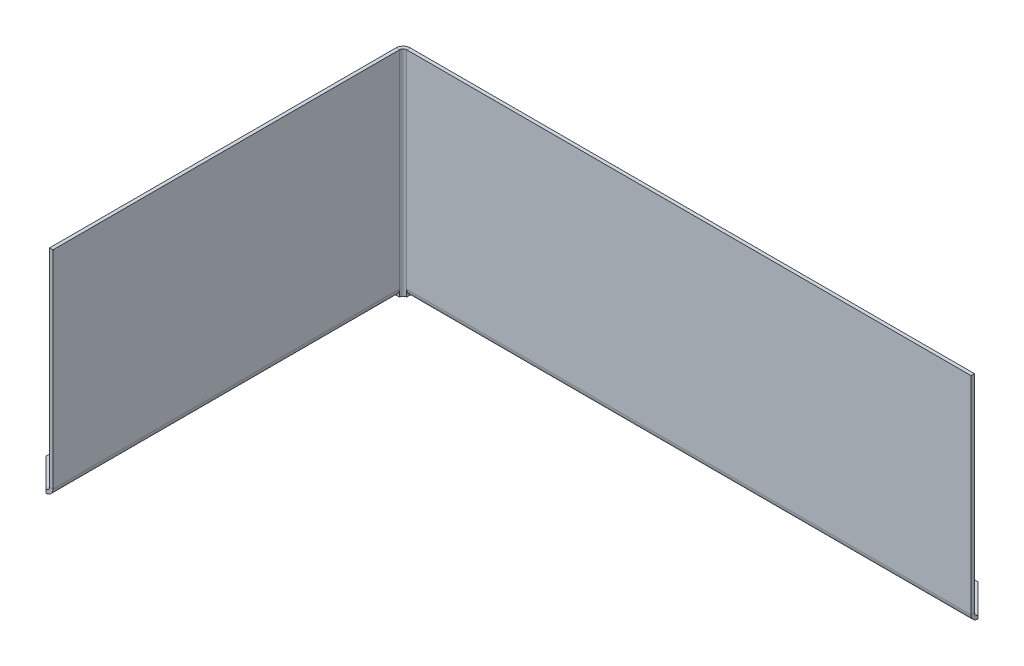
ISO-10303-21;
HEADER;
FILE_DESCRIPTION(('STEP AP214'),'2;1');
FILE_NAME('part.step','',(''),(''),'','','');
FILE_SCHEMA(('AUTOMOTIVE_DESIGN { 1 0 10303 214 1 1 1 1 }'));
ENDSEC;
DATA;
#1=APPLICATION_CONTEXT('core data for automotive mechanical design processes');
#2=APPLICATION_PROTOCOL_DEFINITION('international standard','automotive_design',2000,#1);
#3=PRODUCT_CONTEXT('',#1,'mechanical');
#4=PRODUCT('Part','Part','',(#3));
#5=PRODUCT_RELATED_PRODUCT_CATEGORY('part','',(#4));
#6=PRODUCT_DEFINITION_FORMATION('','',#4);
#7=PRODUCT_DEFINITION_CONTEXT('part definition',#1,'design');
#8=PRODUCT_DEFINITION('design','',#6,#7);
#9=PRODUCT_DEFINITION_SHAPE('','',#8);
#10=(LENGTH_UNIT() NAMED_UNIT(*) SI_UNIT(.MILLI.,.METRE.));
#11=(NAMED_UNIT(*) PLANE_ANGLE_UNIT() SI_UNIT($,.RADIAN.));
#12=(NAMED_UNIT(*) SI_UNIT($,.STERADIAN.) SOLID_ANGLE_UNIT());
#13=UNCERTAINTY_MEASURE_WITH_UNIT(LENGTH_MEASURE(1.E-05),#10,'distance_accuracy_value','');
#14=(GEOMETRIC_REPRESENTATION_CONTEXT(3) GLOBAL_UNCERTAINTY_ASSIGNED_CONTEXT((#13)) GLOBAL_UNIT_ASSIGNED_CONTEXT((#10,
#11,#12)) REPRESENTATION_CONTEXT('',''));
#15=CARTESIAN_POINT('',(0.,0.,0.));
#16=DIRECTION('',(0.,0.,1.));
#17=DIRECTION('',(1.,0.,0.));
#18=AXIS2_PLACEMENT_3D('',#15,#16,#17);
#19=CARTESIAN_POINT('',(1.26999999999998,0.,-125.73));
#20=DIRECTION('',(1.,0.,0.));
#21=DIRECTION('',(0.,1.,0.));
#22=AXIS2_PLACEMENT_3D('',#19,#20,#21);
#23=PLANE('',#22);
#24=DIRECTION('',(0.,1.,-1.33804799689678E-13));
#25=VECTOR('',#24,1.);
#26=CARTESIAN_POINT('',(1.26999999999998,0.,-125.73));
#27=LINE('',#26,#25);
#28=CARTESIAN_POINT('',(1.26999999999998,0.,-125.73));
#29=VERTEX_POINT('',#28);
#30=CARTESIAN_POINT('',(1.26999999999998,0.348355157420486,-125.73));
#31=VERTEX_POINT('',#30);
#32=EDGE_CURVE('E412',#29,#31,#27,.T.);
#33=ORIENTED_EDGE('',*,*,#32,.T.);
#34=CARTESIAN_POINT('',(1.26999999999997,2.4892,-127.));
#35=DIRECTION('',(-1.,0.,0.));
#36=DIRECTION('',(0.,0.,1.));
#37=AXIS2_PLACEMENT_3D('',#34,#35,#36);
#38=CIRCLE('',#37,2.4892);
#39=CARTESIAN_POINT('',(1.26999999999999,2.4892,-124.5108));
#40=VERTEX_POINT('',#39);
#41=EDGE_CURVE('E236',#31,#40,#38,.T.);
#42=ORIENTED_EDGE('',*,*,#41,.T.);
#43=DIRECTION('',(0.,1.,0.));
#44=VECTOR('',#43,1.);
#45=CARTESIAN_POINT('',(1.26999999999999,0.,-124.5108));
#46=LINE('',#45,#44);
#47=CARTESIAN_POINT('',(1.26999999999999,0.,-124.5108));
#48=VERTEX_POINT('',#47);
#49=EDGE_CURVE('E348',#48,#40,#46,.T.);
#50=ORIENTED_EDGE('',*,*,#49,.F.);
#51=DIRECTION('',(0.,0.,1.));
#52=VECTOR('',#51,1.);
#53=CARTESIAN_POINT('',(1.26999999999999,0.,-125.73));
#54=LINE('',#53,#52);
#55=EDGE_CURVE('E329',#48,#29,#54,.F.);
#56=ORIENTED_EDGE('',*,*,#55,.T.);
#57=EDGE_LOOP('',(#33,#42,#50,#56));
#58=FACE_BOUND('',#57,.T.);
#59=ADVANCED_FACE('F96',(#58),#23,.T.);
#60=CARTESIAN_POINT('',(-4.36192488398679E-13,0.,-125.73));
#61=DIRECTION('',(0.,0.,1.));
#62=DIRECTION('',(1.,0.,0.));
#63=AXIS2_PLACEMENT_3D('',#60,#61,#62);
#64=PLANE('',#63);
#65=DIRECTION('',(-1.,0.,0.));
#66=VECTOR('',#65,1.);
#67=CARTESIAN_POINT('',(1.26999999999997,2.4892,-125.73));
#68=LINE('',#67,#66);
#69=CARTESIAN_POINT('',(1.26999999999997,2.4892,-125.73));
#70=VERTEX_POINT('',#69);
#71=CARTESIAN_POINT('',(201.9808,2.4892,-125.730000000001));
#72=VERTEX_POINT('',#71);
#73=EDGE_CURVE('E403',#70,#72,#68,.F.);
#74=ORIENTED_EDGE('',*,*,#73,.F.);
#75=DIRECTION('',(0.,1.,0.));
#76=VECTOR('',#75,1.);
#77=CARTESIAN_POINT('',(1.26999999999999,0.,-125.73));
#78=LINE('',#77,#76);
#79=CARTESIAN_POINT('',(1.26999999999999,76.2,-125.73));
#80=VERTEX_POINT('',#79);
#81=EDGE_CURVE('E343',#80,#70,#78,.F.);
#82=ORIENTED_EDGE('',*,*,#81,.F.);
#83=DIRECTION('',(1.,0.,0.));
#84=VECTOR('',#83,1.);
#85=CARTESIAN_POINT('',(-4.36192488398679E-13,76.2,-125.73));
#86=LINE('',#85,#84);
#87=CARTESIAN_POINT('',(201.9808,76.2,-125.730000000001));
#88=VERTEX_POINT('',#87);
#89=EDGE_CURVE('E337',#80,#88,#86,.T.);
#90=ORIENTED_EDGE('',*,*,#89,.T.);
#91=DIRECTION('',(0.,-1.,0.));
#92=VECTOR('',#91,1.);
#93=CARTESIAN_POINT('',(201.9808,0.,-125.730000000001));
#94=LINE('',#93,#92);
#95=EDGE_CURVE('E334',#88,#72,#94,.T.);
#96=ORIENTED_EDGE('',*,*,#95,.T.);
#97=EDGE_LOOP('',(#74,#82,#90,#96));
#98=FACE_BOUND('',#97,.T.);
#99=ADVANCED_FACE('F459',(#98),#64,.F.);
#100=CARTESIAN_POINT('',(-4.31935674350362E-13,0.,-124.5108));
#101=DIRECTION('',(0.,0.,1.));
#102=DIRECTION('',(1.,0.,0.));
#103=AXIS2_PLACEMENT_3D('',#100,#101,#102);
#104=PLANE('',#103);
#105=CARTESIAN_POINT('',(1.26999999999999,76.2,-124.5108));
#106=VERTEX_POINT('',#105);
#107=EDGE_CURVE('E351',#40,#106,#46,.T.);
#108=ORIENTED_EDGE('',*,*,#107,.F.);
#109=DIRECTION('',(-1.,0.,0.));
#110=VECTOR('',#109,1.);
#111=CARTESIAN_POINT('',(1.26999999999997,2.4892,-124.5108));
#112=LINE('',#111,#110);
#113=CARTESIAN_POINT('',(201.9808,2.4892,-124.510800000001));
#114=VERTEX_POINT('',#113);
#115=EDGE_CURVE('E239',#40,#114,#112,.F.);
#116=ORIENTED_EDGE('',*,*,#115,.T.);
#117=DIRECTION('',(0.,1.,0.));
#118=VECTOR('',#117,1.);
#119=CARTESIAN_POINT('',(201.9808,0.,-124.510800000001));
#120=LINE('',#119,#118);
#121=CARTESIAN_POINT('',(201.9808,76.2,-124.510800000001));
#122=VERTEX_POINT('',#121);
#123=EDGE_CURVE('E339',#122,#114,#120,.F.);
#124=ORIENTED_EDGE('',*,*,#123,.F.);
#125=DIRECTION('',(-1.,0.,0.));
#126=VECTOR('',#125,1.);
#127=CARTESIAN_POINT('',(201.9808,76.2,-124.510800000001));
#128=LINE('',#127,#126);
#129=EDGE_CURVE('E341',#106,#122,#128,.F.);
#130=ORIENTED_EDGE('',*,*,#129,.F.);
#131=EDGE_LOOP('',(#108,#116,#124,#130));
#132=FACE_BOUND('',#131,.T.);
#133=ADVANCED_FACE('F452',(#132),#104,.T.);
#134=CARTESIAN_POINT('',(201.9808,0.,-125.730000000001));
#135=DIRECTION('',(-1.,0.,0.));
#136=DIRECTION('',(0.,0.,1.));
#137=AXIS2_PLACEMENT_3D('',#134,#135,#136);
#138=PLANE('',#137);
#139=DIRECTION('',(0.,0.,1.));
#140=VECTOR('',#139,1.);
#141=CARTESIAN_POINT('',(201.9808,2.4892,-125.73));
#142=LINE('',#141,#140);
#143=EDGE_CURVE('E408',#72,#114,#142,.T.);
#144=ORIENTED_EDGE('',*,*,#143,.F.);
#145=ORIENTED_EDGE('',*,*,#95,.F.);
#146=DIRECTION('',(0.,0.,1.));
#147=VECTOR('',#146,1.);
#148=CARTESIAN_POINT('',(201.9808,76.2,-125.730000000001));
#149=LINE('',#148,#147);
#150=EDGE_CURVE('E330',#88,#122,#149,.T.);
#151=ORIENTED_EDGE('',*,*,#150,.T.);
#152=ORIENTED_EDGE('',*,*,#123,.T.);
#153=EDGE_LOOP('',(#144,#145,#151,#152));
#154=FACE_BOUND('',#153,.T.);
#155=ADVANCED_FACE('F455',(#154),#138,.F.);
#156=CARTESIAN_POINT('',(-1.2192,2.4892,-123.2408));
#157=DIRECTION('',(0.,0.,1.));
#158=DIRECTION('',(1.,0.,0.));
#159=AXIS2_PLACEMENT_3D('',#156,#157,#158);
#160=PLANE('',#159);
#161=DIRECTION('',(0.,1.,0.));
#162=VECTOR('',#161,1.);
#163=CARTESIAN_POINT('',(0.,76.2,-123.2408));
#164=LINE('',#163,#162);
#165=CARTESIAN_POINT('',(0.,2.4892,-123.2408));
#166=VERTEX_POINT('',#165);
#167=CARTESIAN_POINT('',(0.,0.,-123.2408));
#168=VERTEX_POINT('',#167);
#169=EDGE_CURVE('E370',#166,#168,#164,.F.);
#170=ORIENTED_EDGE('',*,*,#169,.F.);
#171=CARTESIAN_POINT('',(-2.4892,2.4892,-123.2408));
#172=DIRECTION('',(0.,0.,1.));
#173=DIRECTION('',(1.,0.,0.));
#174=AXIS2_PLACEMENT_3D('',#171,#172,#173);
#175=CIRCLE('',#174,2.4892);
#176=CARTESIAN_POINT('',(-1.2192,0.348355157420319,-123.2408));
#177=VERTEX_POINT('',#176);
#178=EDGE_CURVE('E325',#166,#177,#175,.F.);
#179=ORIENTED_EDGE('',*,*,#178,.T.);
#180=DIRECTION('',(0.,-1.,0.));
#181=VECTOR('',#180,1.);
#182=CARTESIAN_POINT('',(-1.2192,2.4892,-123.2408));
#183=LINE('',#182,#181);
#184=CARTESIAN_POINT('',(-1.2192,0.,-123.2408));
#185=VERTEX_POINT('',#184);
#186=EDGE_CURVE('E324',#177,#185,#183,.T.);
#187=ORIENTED_EDGE('',*,*,#186,.T.);
#188=DIRECTION('',(-1.,0.,0.));
#189=VECTOR('',#188,1.);
#190=CARTESIAN_POINT('',(0.,0.,-123.2408));
#191=LINE('',#190,#189);
#192=EDGE_CURVE('E373',#168,#185,#191,.T.);
#193=ORIENTED_EDGE('',*,*,#192,.F.);
#194=EDGE_LOOP('',(#170,#179,#187,#193));
#195=FACE_BOUND('',#194,.T.);
#196=ADVANCED_FACE('F513',(#195),#160,.T.);
#197=CARTESIAN_POINT('',(-1.2192,0.,0.));
#198=DIRECTION('',(-1.,0.,0.));
#199=DIRECTION('',(0.,0.,1.));
#200=AXIS2_PLACEMENT_3D('',#197,#198,#199);
#201=PLANE('',#200);
#202=DIRECTION('',(0.,1.,0.));
#203=VECTOR('',#202,1.);
#204=CARTESIAN_POINT('',(-1.2192,76.2,-123.2408));
#205=LINE('',#204,#203);
#206=CARTESIAN_POINT('',(-1.2192,76.2,-123.2408));
#207=VERTEX_POINT('',#206);
#208=CARTESIAN_POINT('',(-1.2192,2.4892,-123.2408));
#209=VERTEX_POINT('',#208);
#210=EDGE_CURVE('E354',#207,#209,#205,.F.);
#211=ORIENTED_EDGE('',*,*,#210,.T.);
#212=DIRECTION('',(0.,0.,1.));
#213=VECTOR('',#212,1.);
#214=CARTESIAN_POINT('',(-1.2192,2.4892,0.));
#215=LINE('',#214,#213);
#216=CARTESIAN_POINT('',(-1.2192,2.4892,0.));
#217=VERTEX_POINT('',#216);
#218=EDGE_CURVE('E318',#217,#209,#215,.F.);
#219=ORIENTED_EDGE('',*,*,#218,.F.);
#220=DIRECTION('',(0.,-1.,0.));
#221=VECTOR('',#220,1.);
#222=CARTESIAN_POINT('',(-1.2192,0.,0.));
#223=LINE('',#222,#221);
#224=CARTESIAN_POINT('',(-1.2192,76.2,0.));
#225=VERTEX_POINT('',#224);
#226=EDGE_CURVE('E379',#225,#217,#223,.T.);
#227=ORIENTED_EDGE('',*,*,#226,.F.);
#228=DIRECTION('',(0.,0.,1.));
#229=VECTOR('',#228,1.);
#230=CARTESIAN_POINT('',(-1.2192,76.2,0.));
#231=LINE('',#230,#229);
#232=EDGE_CURVE('E382',#207,#225,#231,.T.);
#233=ORIENTED_EDGE('',*,*,#232,.F.);
#234=EDGE_LOOP('',(#211,#219,#227,#233));
#235=FACE_BOUND('',#234,.T.);
#236=ADVANCED_FACE('F515',(#235),#201,.T.);
#237=CARTESIAN_POINT('',(0.,0.,0.));
#238=DIRECTION('',(-1.,0.,0.));
#239=DIRECTION('',(0.,0.,1.));
#240=AXIS2_PLACEMENT_3D('',#237,#238,#239);
#241=PLANE('',#240);
#242=DIRECTION('',(0.,0.,1.));
#243=VECTOR('',#242,1.);
#244=CARTESIAN_POINT('',(0.,2.4892,0.));
#245=LINE('',#244,#243);
#246=CARTESIAN_POINT('',(0.,2.4892,0.));
#247=VERTEX_POINT('',#246);
#248=EDGE_CURVE('E419',#247,#166,#245,.F.);
#249=ORIENTED_EDGE('',*,*,#248,.T.);
#250=CARTESIAN_POINT('',(0.,76.2,-123.2408));
#251=VERTEX_POINT('',#250);
#252=EDGE_CURVE('E367',#251,#166,#164,.F.);
#253=ORIENTED_EDGE('',*,*,#252,.F.);
#254=DIRECTION('',(0.,0.,1.));
#255=VECTOR('',#254,1.);
#256=CARTESIAN_POINT('',(0.,76.2,0.));
#257=LINE('',#256,#255);
#258=CARTESIAN_POINT('',(0.,76.2,0.));
#259=VERTEX_POINT('',#258);
#260=EDGE_CURVE('E383',#251,#259,#257,.T.);
#261=ORIENTED_EDGE('',*,*,#260,.T.);
#262=DIRECTION('',(0.,-1.,0.));
#263=VECTOR('',#262,1.);
#264=CARTESIAN_POINT('',(0.,0.,0.));
#265=LINE('',#264,#263);
#266=EDGE_CURVE('E376',#259,#247,#265,.T.);
#267=ORIENTED_EDGE('',*,*,#266,.T.);
#268=EDGE_LOOP('',(#249,#253,#261,#267));
#269=FACE_BOUND('',#268,.T.);
#270=ADVANCED_FACE('F433',(#269),#241,.F.);
#271=CARTESIAN_POINT('',(-1.2192,0.,0.));
#272=DIRECTION('',(0.,0.,1.));
#273=DIRECTION('',(1.,0.,0.));
#274=AXIS2_PLACEMENT_3D('',#271,#272,#273);
#275=PLANE('',#274);
#276=ORIENTED_EDGE('',*,*,#226,.T.);
#277=DIRECTION('',(1.,0.,0.));
#278=VECTOR('',#277,1.);
#279=CARTESIAN_POINT('',(-1.2192,2.4892,0.));
#280=LINE('',#279,#278);
#281=EDGE_CURVE('E317',#217,#247,#280,.T.);
#282=ORIENTED_EDGE('',*,*,#281,.T.);
#283=ORIENTED_EDGE('',*,*,#266,.F.);
#284=DIRECTION('',(1.,0.,0.));
#285=VECTOR('',#284,1.);
#286=CARTESIAN_POINT('',(-1.2192,76.2,0.));
#287=LINE('',#286,#285);
#288=EDGE_CURVE('E385',#225,#259,#287,.T.);
#289=ORIENTED_EDGE('',*,*,#288,.F.);
#290=EDGE_LOOP('',(#276,#282,#283,#289));
#291=FACE_BOUND('',#290,.T.);
#292=ADVANCED_FACE('F542',(#291),#275,.T.);
#293=CARTESIAN_POINT('',(-1.2192,76.2,0.));
#294=DIRECTION('',(0.,1.,0.));
#295=DIRECTION('',(0.,0.,1.));
#296=AXIS2_PLACEMENT_3D('',#293,#294,#295);
#297=PLANE('',#296);
#298=ORIENTED_EDGE('',*,*,#260,.F.);
#299=DIRECTION('',(-1.,0.,0.));
#300=VECTOR('',#299,1.);
#301=CARTESIAN_POINT('',(0.,76.2,-123.2408));
#302=LINE('',#301,#300);
#303=EDGE_CURVE('E361',#251,#207,#302,.T.);
#304=ORIENTED_EDGE('',*,*,#303,.T.);
#305=ORIENTED_EDGE('',*,*,#232,.T.);
#306=ORIENTED_EDGE('',*,*,#288,.T.);
#307=EDGE_LOOP('',(#298,#304,#305,#306));
#308=FACE_BOUND('',#307,.T.);
#309=ADVANCED_FACE('F533',(#308),#297,.T.);
#310=CARTESIAN_POINT('',(1.26999999999999,0.,-123.2408));
#311=DIRECTION('',(0.,-1.,0.));
#312=DIRECTION('',(0.,0.,-1.));
#313=AXIS2_PLACEMENT_3D('',#310,#311,#312);
#314=PLANE('',#313);
#315=ORIENTED_EDGE('',*,*,#55,.F.);
#316=CARTESIAN_POINT('',(1.26999999999999,0.,-123.2408));
#317=DIRECTION('',(0.,1.,0.));
#318=DIRECTION('',(0.,0.,1.));
#319=AXIS2_PLACEMENT_3D('',#316,#317,#318);
#320=CIRCLE('',#319,1.26999999999999);
#321=EDGE_CURVE('E364',#168,#48,#320,.F.);
#322=ORIENTED_EDGE('',*,*,#321,.F.);
#323=ORIENTED_EDGE('',*,*,#192,.T.);
#324=CARTESIAN_POINT('',(1.26999999999999,0.,-123.2408));
#325=DIRECTION('',(0.,1.,0.));
#326=DIRECTION('',(0.,0.,1.));
#327=AXIS2_PLACEMENT_3D('',#324,#325,#326);
#328=CIRCLE('',#327,2.48919999999999);
#329=EDGE_CURVE('E357',#185,#29,#328,.F.);
#330=ORIENTED_EDGE('',*,*,#329,.T.);
#331=EDGE_LOOP('',(#315,#322,#323,#330));
#332=FACE_BOUND('',#331,.T.);
#333=ADVANCED_FACE('F530',(#332),#314,.T.);
#334=CARTESIAN_POINT('',(1.26999999999999,76.2,-123.2408));
#335=DIRECTION('',(0.,-1.,0.));
#336=DIRECTION('',(0.,0.,-1.));
#337=AXIS2_PLACEMENT_3D('',#334,#335,#336);
#338=PLANE('',#337);
#339=CARTESIAN_POINT('',(1.26999999999999,76.2,-123.2408));
#340=DIRECTION('',(0.,1.,0.));
#341=DIRECTION('',(0.,0.,1.));
#342=AXIS2_PLACEMENT_3D('',#339,#340,#341);
#343=CIRCLE('',#342,1.26999999999999);
#344=EDGE_CURVE('E333',#106,#251,#343,.T.);
#345=ORIENTED_EDGE('',*,*,#344,.F.);
#346=DIRECTION('',(0.,0.,1.));
#347=VECTOR('',#346,1.);
#348=CARTESIAN_POINT('',(1.26999999999999,76.2,-124.5108));
#349=LINE('',#348,#347);
#350=EDGE_CURVE('E345',#106,#80,#349,.F.);
#351=ORIENTED_EDGE('',*,*,#350,.T.);
#352=CARTESIAN_POINT('',(1.26999999999999,76.2,-123.2408));
#353=DIRECTION('',(0.,1.,0.));
#354=DIRECTION('',(0.,0.,1.));
#355=AXIS2_PLACEMENT_3D('',#352,#353,#354);
#356=CIRCLE('',#355,2.48919999999999);
#357=EDGE_CURVE('E358',#80,#207,#356,.T.);
#358=ORIENTED_EDGE('',*,*,#357,.T.);
#359=ORIENTED_EDGE('',*,*,#303,.F.);
#360=EDGE_LOOP('',(#345,#351,#358,#359));
#361=FACE_BOUND('',#360,.T.);
#362=ADVANCED_FACE('F443',(#361),#338,.F.);
#363=CARTESIAN_POINT('',(1.26999999999999,76.2,-123.2408));
#364=DIRECTION('',(0.,1.,0.));
#365=DIRECTION('',(0.,0.,-1.));
#366=AXIS2_PLACEMENT_3D('',#363,#364,#365);
#367=CYLINDRICAL_SURFACE('',#366,2.48919999999999);
#368=ORIENTED_EDGE('',*,*,#210,.F.);
#369=ORIENTED_EDGE('',*,*,#357,.F.);
#370=ORIENTED_EDGE('',*,*,#81,.T.);
#371=EDGE_CURVE('E411',#31,#70,#27,.T.);
#372=ORIENTED_EDGE('',*,*,#371,.F.);
#373=ORIENTED_EDGE('',*,*,#32,.F.);
#374=ORIENTED_EDGE('',*,*,#329,.F.);
#375=ORIENTED_EDGE('',*,*,#186,.F.);
#376=EDGE_CURVE('E326',#209,#177,#183,.T.);
#377=ORIENTED_EDGE('',*,*,#376,.F.);
#378=EDGE_LOOP('',(#368,#369,#370,#372,#373,#374,#375,#377));
#379=FACE_BOUND('',#378,.T.);
#380=ADVANCED_FACE('F524',(#379),#367,.T.);
#381=CARTESIAN_POINT('',(1.26999999999999,76.2,-123.2408));
#382=DIRECTION('',(0.,1.,0.));
#383=DIRECTION('',(0.,0.,-1.));
#384=AXIS2_PLACEMENT_3D('',#381,#382,#383);
#385=CYLINDRICAL_SURFACE('',#384,1.26999999999999);
#386=ORIENTED_EDGE('',*,*,#252,.T.);
#387=ORIENTED_EDGE('',*,*,#169,.T.);
#388=ORIENTED_EDGE('',*,*,#321,.T.);
#389=ORIENTED_EDGE('',*,*,#49,.T.);
#390=ORIENTED_EDGE('',*,*,#107,.T.);
#391=ORIENTED_EDGE('',*,*,#344,.T.);
#392=EDGE_LOOP('',(#386,#387,#388,#389,#390,#391));
#393=FACE_BOUND('',#392,.T.);
#394=ADVANCED_FACE('F438',(#393),#385,.F.);
#395=CARTESIAN_POINT('',(201.9808,76.2,-125.730000000001));
#396=DIRECTION('',(0.,-1.,0.));
#397=DIRECTION('',(0.,0.,-1.));
#398=AXIS2_PLACEMENT_3D('',#395,#396,#397);
#399=PLANE('',#398);
#400=ORIENTED_EDGE('',*,*,#350,.F.);
#401=ORIENTED_EDGE('',*,*,#129,.T.);
#402=ORIENTED_EDGE('',*,*,#150,.F.);
#403=ORIENTED_EDGE('',*,*,#89,.F.);
#404=EDGE_LOOP('',(#400,#401,#402,#403));
#405=FACE_BOUND('',#404,.T.);
#406=ADVANCED_FACE('F448',(#405),#399,.F.);
#407=CARTESIAN_POINT('',(-2.4892,2.4892,-123.2408));
#408=DIRECTION('',(0.,0.,-1.));
#409=DIRECTION('',(-1.,0.,0.));
#410=AXIS2_PLACEMENT_3D('',#407,#408,#409);
#411=PLANE('',#410);
#412=CARTESIAN_POINT('',(-2.4892,2.4892,-123.2408));
#413=DIRECTION('',(0.,0.,1.));
#414=DIRECTION('',(1.,0.,0.));
#415=AXIS2_PLACEMENT_3D('',#412,#413,#414);
#416=CIRCLE('',#415,1.27);
#417=CARTESIAN_POINT('',(-2.4892,1.2192,-123.2408));
#418=VERTEX_POINT('',#417);
#419=EDGE_CURVE('E310',#209,#418,#416,.F.);
#420=ORIENTED_EDGE('',*,*,#419,.F.);
#421=ORIENTED_EDGE('',*,*,#376,.T.);
#422=CARTESIAN_POINT('',(-2.48919999999999,0.,-123.2408));
#423=VERTEX_POINT('',#422);
#424=EDGE_CURVE('E422',#177,#423,#175,.F.);
#425=ORIENTED_EDGE('',*,*,#424,.T.);
#426=DIRECTION('',(0.,1.,0.));
#427=VECTOR('',#426,1.);
#428=CARTESIAN_POINT('',(-2.48919999999999,0.,-123.2408));
#429=LINE('',#428,#427);
#430=EDGE_CURVE('E311',#418,#423,#429,.F.);
#431=ORIENTED_EDGE('',*,*,#430,.F.);
#432=EDGE_LOOP('',(#420,#421,#425,#431));
#433=FACE_BOUND('',#432,.T.);
#434=ADVANCED_FACE('F507',(#433),#411,.T.);
#435=CARTESIAN_POINT('',(-2.4892,2.4892,0.));
#436=DIRECTION('',(0.,0.,-1.));
#437=DIRECTION('',(-1.,0.,0.));
#438=AXIS2_PLACEMENT_3D('',#435,#436,#437);
#439=PLANE('',#438);
#440=CARTESIAN_POINT('',(-2.4892,2.4892,0.));
#441=DIRECTION('',(0.,0.,1.));
#442=DIRECTION('',(1.,0.,0.));
#443=AXIS2_PLACEMENT_3D('',#440,#441,#442);
#444=CIRCLE('',#443,1.27);
#445=CARTESIAN_POINT('',(-2.4892,1.2192,0.));
#446=VERTEX_POINT('',#445);
#447=EDGE_CURVE('E294',#446,#217,#444,.T.);
#448=ORIENTED_EDGE('',*,*,#447,.F.);
#449=DIRECTION('',(0.,1.,0.));
#450=VECTOR('',#449,1.);
#451=CARTESIAN_POINT('',(-2.4892,1.2192,0.));
#452=LINE('',#451,#450);
#453=CARTESIAN_POINT('',(-2.48919999999999,0.,0.));
#454=VERTEX_POINT('',#453);
#455=EDGE_CURVE('E299',#446,#454,#452,.F.);
#456=ORIENTED_EDGE('',*,*,#455,.T.);
#457=CARTESIAN_POINT('',(-2.4892,2.4892,0.));
#458=DIRECTION('',(0.,0.,1.));
#459=DIRECTION('',(1.,0.,0.));
#460=AXIS2_PLACEMENT_3D('',#457,#458,#459);
#461=CIRCLE('',#460,2.4892);
#462=EDGE_CURVE('E423',#454,#247,#461,.T.);
#463=ORIENTED_EDGE('',*,*,#462,.T.);
#464=ORIENTED_EDGE('',*,*,#281,.F.);
#465=EDGE_LOOP('',(#448,#456,#463,#464));
#466=FACE_BOUND('',#465,.T.);
#467=ADVANCED_FACE('F315',(#466),#439,.F.);
#468=CARTESIAN_POINT('',(-2.4892,2.4892,0.));
#469=DIRECTION('',(0.,0.,1.));
#470=DIRECTION('',(0.,-1.,0.));
#471=AXIS2_PLACEMENT_3D('',#468,#469,#470);
#472=CYLINDRICAL_SURFACE('',#471,2.4892);
#473=ORIENTED_EDGE('',*,*,#248,.F.);
#474=ORIENTED_EDGE('',*,*,#462,.F.);
#475=DIRECTION('',(0.,0.,1.));
#476=VECTOR('',#475,1.);
#477=CARTESIAN_POINT('',(-2.48919999999999,0.,-123.2408));
#478=LINE('',#477,#476);
#479=EDGE_CURVE('E289',#454,#423,#478,.F.);
#480=ORIENTED_EDGE('',*,*,#479,.T.);
#481=ORIENTED_EDGE('',*,*,#424,.F.);
#482=ORIENTED_EDGE('',*,*,#178,.F.);
#483=EDGE_LOOP('',(#473,#474,#480,#481,#482));
#484=FACE_BOUND('',#483,.T.);
#485=ADVANCED_FACE('F428',(#484),#472,.T.);
#486=CARTESIAN_POINT('',(-2.4892,2.4892,0.));
#487=DIRECTION('',(0.,0.,1.));
#488=DIRECTION('',(0.,-1.,0.));
#489=AXIS2_PLACEMENT_3D('',#486,#487,#488);
#490=CYLINDRICAL_SURFACE('',#489,1.27);
#491=ORIENTED_EDGE('',*,*,#218,.T.);
#492=ORIENTED_EDGE('',*,*,#419,.T.);
#493=DIRECTION('',(0.,0.,1.));
#494=VECTOR('',#493,1.);
#495=CARTESIAN_POINT('',(-2.4892,1.2192,-123.2408));
#496=LINE('',#495,#494);
#497=EDGE_CURVE('E302',#418,#446,#496,.T.);
#498=ORIENTED_EDGE('',*,*,#497,.T.);
#499=ORIENTED_EDGE('',*,*,#447,.T.);
#500=EDGE_LOOP('',(#491,#492,#498,#499));
#501=FACE_BOUND('',#500,.T.);
#502=ADVANCED_FACE('F308',(#501),#490,.F.);
#503=CARTESIAN_POINT('',(0.,0.,0.));
#504=DIRECTION('',(0.,1.,0.));
#505=DIRECTION('',(-1.,0.,0.));
#506=AXIS2_PLACEMENT_3D('',#503,#504,#505);
#507=PLANE('',#506);
#508=DIRECTION('',(0.,0.,-1.));
#509=VECTOR('',#508,1.);
#510=CARTESIAN_POINT('',(-12.7,0.,0.));
#511=LINE('',#510,#509);
#512=CARTESIAN_POINT('',(-12.7,0.,-10.2108));
#513=VERTEX_POINT('',#512);
#514=CARTESIAN_POINT('',(-12.7,0.,-113.03));
#515=VERTEX_POINT('',#514);
#516=EDGE_CURVE('E286',#513,#515,#511,.T.);
#517=ORIENTED_EDGE('',*,*,#516,.T.);
#518=DIRECTION('',(-0.707106781186547,0.,0.707106781186548));
#519=VECTOR('',#518,1.);
#520=CARTESIAN_POINT('',(-2.4892,0.,-123.2408));
#521=LINE('',#520,#519);
#522=EDGE_CURVE('E13',#515,#423,#521,.F.);
#523=ORIENTED_EDGE('',*,*,#522,.T.);
#524=ORIENTED_EDGE('',*,*,#479,.F.);
#525=DIRECTION('',(0.707106781186547,0.,0.707106781186548));
#526=VECTOR('',#525,1.);
#527=CARTESIAN_POINT('',(-12.7,0.,-10.2108));
#528=LINE('',#527,#526);
#529=EDGE_CURVE('E280',#454,#513,#528,.F.);
#530=ORIENTED_EDGE('',*,*,#529,.T.);
#531=EDGE_LOOP('',(#517,#523,#524,#530));
#532=FACE_BOUND('',#531,.T.);
#533=ADVANCED_FACE('F285',(#532),#507,.F.);
#534=CARTESIAN_POINT('',(0.,1.2192,0.));
#535=DIRECTION('',(0.,1.,0.));
#536=DIRECTION('',(-1.,0.,0.));
#537=AXIS2_PLACEMENT_3D('',#534,#535,#536);
#538=PLANE('',#537);
#539=ORIENTED_EDGE('',*,*,#497,.F.);
#540=DIRECTION('',(0.707106781186547,0.,-0.707106781186548));
#541=VECTOR('',#540,1.);
#542=CARTESIAN_POINT('',(-62.865,1.21919999999978,-62.865));
#543=LINE('',#542,#541);
#544=CARTESIAN_POINT('',(-12.7,1.21919999999996,-113.03));
#545=VERTEX_POINT('',#544);
#546=EDGE_CURVE('E118',#418,#545,#543,.F.);
#547=ORIENTED_EDGE('',*,*,#546,.T.);
#548=DIRECTION('',(0.,0.,1.));
#549=VECTOR('',#548,1.);
#550=CARTESIAN_POINT('',(-12.7,1.21919999999996,-123.2408));
#551=LINE('',#550,#549);
#552=CARTESIAN_POINT('',(-12.7,1.21919999999996,-10.2108));
#553=VERTEX_POINT('',#552);
#554=EDGE_CURVE('E295',#553,#545,#551,.F.);
#555=ORIENTED_EDGE('',*,*,#554,.F.);
#556=DIRECTION('',(-0.707106781186547,0.,-0.707106781186548));
#557=VECTOR('',#556,1.);
#558=CARTESIAN_POINT('',(-1.2446,1.2192,1.2446));
#559=LINE('',#558,#557);
#560=EDGE_CURVE('E278',#553,#446,#559,.F.);
#561=ORIENTED_EDGE('',*,*,#560,.T.);
#562=EDGE_LOOP('',(#539,#547,#555,#561));
#563=FACE_BOUND('',#562,.T.);
#564=ADVANCED_FACE('F301',(#563),#538,.T.);
#565=CARTESIAN_POINT('',(-12.7,0.,-123.2408));
#566=DIRECTION('',(1.,0.,0.));
#567=DIRECTION('',(0.,1.,0.));
#568=AXIS2_PLACEMENT_3D('',#565,#566,#567);
#569=PLANE('',#568);
#570=ORIENTED_EDGE('',*,*,#554,.T.);
#571=DIRECTION('',(0.,-1.,0.));
#572=VECTOR('',#571,1.);
#573=CARTESIAN_POINT('',(-12.7,0.,-113.03));
#574=LINE('',#573,#572);
#575=EDGE_CURVE('E104',#545,#515,#574,.T.);
#576=ORIENTED_EDGE('',*,*,#575,.T.);
#577=ORIENTED_EDGE('',*,*,#516,.F.);
#578=DIRECTION('',(0.,1.,0.));
#579=VECTOR('',#578,1.);
#580=CARTESIAN_POINT('',(-12.7,0.,-10.2108));
#581=LINE('',#580,#579);
#582=EDGE_CURVE('E275',#513,#553,#581,.T.);
#583=ORIENTED_EDGE('',*,*,#582,.T.);
#584=EDGE_LOOP('',(#570,#576,#577,#583));
#585=FACE_BOUND('',#584,.T.);
#586=ADVANCED_FACE('F293',(#585),#569,.F.);
#587=CARTESIAN_POINT('',(201.9808,2.4892,-127.));
#588=DIRECTION('',(1.,0.,0.));
#589=DIRECTION('',(0.,0.,-1.));
#590=AXIS2_PLACEMENT_3D('',#587,#588,#589);
#591=PLANE('',#590);
#592=DIRECTION('',(0.,1.,0.));
#593=VECTOR('',#592,1.);
#594=CARTESIAN_POINT('',(201.9808,0.,-127.000000000001));
#595=LINE('',#594,#593);
#596=CARTESIAN_POINT('',(201.9808,1.2192,-127.));
#597=VERTEX_POINT('',#596);
#598=CARTESIAN_POINT('',(201.9808,0.,-127.));
#599=VERTEX_POINT('',#598);
#600=EDGE_CURVE('E469',#597,#599,#595,.F.);
#601=ORIENTED_EDGE('',*,*,#600,.F.);
#602=CARTESIAN_POINT('',(201.9808,2.4892,-127.));
#603=DIRECTION('',(-1.,0.,0.));
#604=DIRECTION('',(0.,0.,1.));
#605=AXIS2_PLACEMENT_3D('',#602,#603,#604);
#606=CIRCLE('',#605,1.27);
#607=EDGE_CURVE('E240',#72,#597,#606,.F.);
#608=ORIENTED_EDGE('',*,*,#607,.F.);
#609=ORIENTED_EDGE('',*,*,#143,.T.);
#610=CARTESIAN_POINT('',(201.9808,2.4892,-127.));
#611=DIRECTION('',(-1.,0.,0.));
#612=DIRECTION('',(0.,0.,1.));
#613=AXIS2_PLACEMENT_3D('',#610,#611,#612);
#614=CIRCLE('',#613,2.4892);
#615=EDGE_CURVE('E399',#114,#599,#614,.F.);
#616=ORIENTED_EDGE('',*,*,#615,.T.);
#617=EDGE_LOOP('',(#601,#608,#609,#616));
#618=FACE_BOUND('',#617,.T.);
#619=ADVANCED_FACE('F467',(#618),#591,.T.);
#620=CARTESIAN_POINT('',(1.26999999999997,2.4892,-127.));
#621=DIRECTION('',(1.,0.,0.));
#622=DIRECTION('',(0.,0.,-1.));
#623=AXIS2_PLACEMENT_3D('',#620,#621,#622);
#624=PLANE('',#623);
#625=CARTESIAN_POINT('',(1.26999999999997,0.,-127.));
#626=VERTEX_POINT('',#625);
#627=EDGE_CURVE('E228',#626,#31,#38,.T.);
#628=ORIENTED_EDGE('',*,*,#627,.T.);
#629=ORIENTED_EDGE('',*,*,#371,.T.);
#630=CARTESIAN_POINT('',(1.26999999999997,2.4892,-127.));
#631=DIRECTION('',(-1.,0.,0.));
#632=DIRECTION('',(0.,0.,1.));
#633=AXIS2_PLACEMENT_3D('',#630,#631,#632);
#634=CIRCLE('',#633,1.27);
#635=CARTESIAN_POINT('',(1.26999999999997,1.2192,-127.));
#636=VERTEX_POINT('',#635);
#637=EDGE_CURVE('E247',#636,#70,#634,.T.);
#638=ORIENTED_EDGE('',*,*,#637,.F.);
#639=DIRECTION('',(0.,1.,0.));
#640=VECTOR('',#639,1.);
#641=CARTESIAN_POINT('',(1.26999999999997,1.2192,-127.));
#642=LINE('',#641,#640);
#643=EDGE_CURVE('E244',#636,#626,#642,.F.);
#644=ORIENTED_EDGE('',*,*,#643,.T.);
#645=EDGE_LOOP('',(#628,#629,#638,#644));
#646=FACE_BOUND('',#645,.T.);
#647=ADVANCED_FACE('F245',(#646),#624,.F.);
#648=CARTESIAN_POINT('',(1.26999999999997,2.4892,-127.));
#649=DIRECTION('',(-1.,0.,0.));
#650=DIRECTION('',(0.,-1.,0.));
#651=AXIS2_PLACEMENT_3D('',#648,#649,#650);
#652=CYLINDRICAL_SURFACE('',#651,2.4892);
#653=ORIENTED_EDGE('',*,*,#115,.F.);
#654=ORIENTED_EDGE('',*,*,#41,.F.);
#655=ORIENTED_EDGE('',*,*,#627,.F.);
#656=DIRECTION('',(-1.,0.,0.));
#657=VECTOR('',#656,1.);
#658=CARTESIAN_POINT('',(201.9808,0.,-127.000000000001));
#659=LINE('',#658,#657);
#660=EDGE_CURVE('E234',#626,#599,#659,.F.);
#661=ORIENTED_EDGE('',*,*,#660,.T.);
#662=ORIENTED_EDGE('',*,*,#615,.F.);
#663=EDGE_LOOP('',(#653,#654,#655,#661,#662));
#664=FACE_BOUND('',#663,.T.);
#665=ADVANCED_FACE('F231',(#664),#652,.T.);
#666=CARTESIAN_POINT('',(1.26999999999997,2.4892,-127.));
#667=DIRECTION('',(-1.,0.,0.));
#668=DIRECTION('',(0.,-1.,0.));
#669=AXIS2_PLACEMENT_3D('',#666,#667,#668);
#670=CYLINDRICAL_SURFACE('',#669,1.27);
#671=ORIENTED_EDGE('',*,*,#73,.T.);
#672=ORIENTED_EDGE('',*,*,#607,.T.);
#673=DIRECTION('',(-1.,0.,0.));
#674=VECTOR('',#673,1.);
#675=CARTESIAN_POINT('',(201.9808,1.2192,-127.000000000001));
#676=LINE('',#675,#674);
#677=EDGE_CURVE('E250',#597,#636,#676,.T.);
#678=ORIENTED_EDGE('',*,*,#677,.T.);
#679=ORIENTED_EDGE('',*,*,#637,.T.);
#680=EDGE_LOOP('',(#671,#672,#678,#679));
#681=FACE_BOUND('',#680,.T.);
#682=ADVANCED_FACE('F462',(#681),#670,.F.);
#683=CARTESIAN_POINT('',(0.,4.38885039422132E-13,0.));
#684=DIRECTION('',(0.,1.,0.));
#685=DIRECTION('',(0.,0.,1.));
#686=AXIS2_PLACEMENT_3D('',#683,#684,#685);
#687=PLANE('',#686);
#688=DIRECTION('',(1.,0.,0.));
#689=VECTOR('',#688,1.);
#690=CARTESIAN_POINT('',(-4.74359717399479E-13,0.,-137.2108));
#691=LINE('',#690,#689);
#692=CARTESIAN_POINT('',(11.4808,0.,-137.2108));
#693=VERTEX_POINT('',#692);
#694=CARTESIAN_POINT('',(191.77,0.,-137.210800000001));
#695=VERTEX_POINT('',#694);
#696=EDGE_CURVE('E407',#693,#695,#691,.T.);
#697=ORIENTED_EDGE('',*,*,#696,.T.);
#698=DIRECTION('',(-0.707106781186549,0.,-0.707106781186546));
#699=VECTOR('',#698,1.);
#700=CARTESIAN_POINT('',(201.9808,0.,-127.000000000001));
#701=LINE('',#700,#699);
#702=EDGE_CURVE('E258',#695,#599,#701,.F.);
#703=ORIENTED_EDGE('',*,*,#702,.T.);
#704=ORIENTED_EDGE('',*,*,#660,.F.);
#705=DIRECTION('',(-0.707106781186546,0.,0.707106781186549));
#706=VECTOR('',#705,1.);
#707=CARTESIAN_POINT('',(11.4808,0.,-137.2108));
#708=LINE('',#707,#706);
#709=EDGE_CURVE('E255',#626,#693,#708,.F.);
#710=ORIENTED_EDGE('',*,*,#709,.T.);
#711=EDGE_LOOP('',(#697,#703,#704,#710));
#712=FACE_BOUND('',#711,.T.);
#713=ADVANCED_FACE('F254',(#712),#687,.F.);
#714=CARTESIAN_POINT('',(0.,1.21920000000044,0.));
#715=DIRECTION('',(0.,1.,0.));
#716=DIRECTION('',(0.,0.,1.));
#717=AXIS2_PLACEMENT_3D('',#714,#715,#716);
#718=PLANE('',#717);
#719=ORIENTED_EDGE('',*,*,#677,.F.);
#720=DIRECTION('',(0.707106781186549,0.,0.707106781186546));
#721=VECTOR('',#720,1.);
#722=CARTESIAN_POINT('',(164.4904,1.21919999999986,-164.490400000001));
#723=LINE('',#722,#721);
#724=CARTESIAN_POINT('',(191.77,1.21919999999996,-137.210800000001));
#725=VERTEX_POINT('',#724);
#726=EDGE_CURVE('E265',#597,#725,#723,.F.);
#727=ORIENTED_EDGE('',*,*,#726,.T.);
#728=DIRECTION('',(-1.,0.,0.));
#729=VECTOR('',#728,1.);
#730=CARTESIAN_POINT('',(201.9808,1.21919999999996,-137.210800000001));
#731=LINE('',#730,#729);
#732=CARTESIAN_POINT('',(11.4808,1.21919999999996,-137.2108));
#733=VERTEX_POINT('',#732);
#734=EDGE_CURVE('E259',#733,#725,#731,.F.);
#735=ORIENTED_EDGE('',*,*,#734,.F.);
#736=DIRECTION('',(0.707106781186546,0.,-0.707106781186549));
#737=VECTOR('',#736,1.);
#738=CARTESIAN_POINT('',(-62.865,1.21920000000022,-62.8649999999998));
#739=LINE('',#738,#737);
#740=EDGE_CURVE('E266',#733,#636,#739,.F.);
#741=ORIENTED_EDGE('',*,*,#740,.T.);
#742=EDGE_LOOP('',(#719,#727,#735,#741));
#743=FACE_BOUND('',#742,.T.);
#744=ADVANCED_FACE('F479',(#743),#718,.T.);
#745=CARTESIAN_POINT('',(201.9808,0.,-137.210800000001));
#746=DIRECTION('',(0.,0.,1.));
#747=DIRECTION('',(0.,-1.,0.));
#748=AXIS2_PLACEMENT_3D('',#745,#746,#747);
#749=PLANE('',#748);
#750=ORIENTED_EDGE('',*,*,#734,.T.);
#751=DIRECTION('',(0.,-1.,0.));
#752=VECTOR('',#751,1.);
#753=CARTESIAN_POINT('',(191.77,0.,-137.210800000001));
#754=LINE('',#753,#752);
#755=EDGE_CURVE('E268',#725,#695,#754,.T.);
#756=ORIENTED_EDGE('',*,*,#755,.T.);
#757=ORIENTED_EDGE('',*,*,#696,.F.);
#758=DIRECTION('',(0.,1.,0.));
#759=VECTOR('',#758,1.);
#760=CARTESIAN_POINT('',(11.4808,0.,-137.2108));
#761=LINE('',#760,#759);
#762=EDGE_CURVE('E264',#693,#733,#761,.T.);
#763=ORIENTED_EDGE('',*,*,#762,.T.);
#764=EDGE_LOOP('',(#750,#756,#757,#763));
#765=FACE_BOUND('',#764,.T.);
#766=ADVANCED_FACE('F477',(#765),#749,.F.);
#767=CARTESIAN_POINT('',(11.4808,0.,-137.2108));
#768=DIRECTION('',(0.707106781186549,0.,0.707106781186546));
#769=DIRECTION('',(0.,1.,0.));
#770=AXIS2_PLACEMENT_3D('',#767,#768,#769);
#771=PLANE('',#770);
#772=ORIENTED_EDGE('',*,*,#709,.F.);
#773=ORIENTED_EDGE('',*,*,#643,.F.);
#774=ORIENTED_EDGE('',*,*,#740,.F.);
#775=ORIENTED_EDGE('',*,*,#762,.F.);
#776=EDGE_LOOP('',(#772,#773,#774,#775));
#777=FACE_BOUND('',#776,.T.);
#778=ADVANCED_FACE('F262',(#777),#771,.F.);
#779=CARTESIAN_POINT('',(201.9808,0.,-127.000000000001));
#780=DIRECTION('',(-0.707106781186546,0.,0.707106781186549));
#781=DIRECTION('',(0.,1.,0.));
#782=AXIS2_PLACEMENT_3D('',#779,#780,#781);
#783=PLANE('',#782);
#784=ORIENTED_EDGE('',*,*,#702,.F.);
#785=ORIENTED_EDGE('',*,*,#755,.F.);
#786=ORIENTED_EDGE('',*,*,#726,.F.);
#787=ORIENTED_EDGE('',*,*,#600,.T.);
#788=EDGE_LOOP('',(#784,#785,#786,#787));
#789=FACE_BOUND('',#788,.T.);
#790=ADVANCED_FACE('F476',(#789),#783,.F.);
#791=CARTESIAN_POINT('',(-12.7,0.,-10.2108));
#792=DIRECTION('',(0.707106781186548,0.,-0.707106781186547));
#793=DIRECTION('',(0.,1.,0.));
#794=AXIS2_PLACEMENT_3D('',#791,#792,#793);
#795=PLANE('',#794);
#796=ORIENTED_EDGE('',*,*,#529,.F.);
#797=ORIENTED_EDGE('',*,*,#455,.F.);
#798=ORIENTED_EDGE('',*,*,#560,.F.);
#799=ORIENTED_EDGE('',*,*,#582,.F.);
#800=EDGE_LOOP('',(#796,#797,#798,#799));
#801=FACE_BOUND('',#800,.T.);
#802=ADVANCED_FACE('F297',(#801),#795,.F.);
#803=CARTESIAN_POINT('',(-2.4892,0.,-123.2408));
#804=DIRECTION('',(0.707106781186548,0.,0.707106781186547));
#805=DIRECTION('',(0.,1.,0.));
#806=AXIS2_PLACEMENT_3D('',#803,#804,#805);
#807=PLANE('',#806);
#808=ORIENTED_EDGE('',*,*,#522,.F.);
#809=ORIENTED_EDGE('',*,*,#575,.F.);
#810=ORIENTED_EDGE('',*,*,#546,.F.);
#811=ORIENTED_EDGE('',*,*,#430,.T.);
#812=EDGE_LOOP('',(#808,#809,#810,#811));
#813=FACE_BOUND('',#812,.T.);
#814=ADVANCED_FACE('F98',(#813),#807,.F.);
#815=CLOSED_SHELL('',(#59,#99,#133,#155,#196,#236,#270,#292,#309,#333,#362,#380,#394,#406,#434,
#467,#485,#502,#533,#564,#586,#619,#647,#665,#682,#713,#744,#766,#778,#790,#802,#814));
#816=MANIFOLD_SOLID_BREP('B2',#815);
#817=ADVANCED_BREP_SHAPE_REPRESENTATION('',(#18,#816),#14);
#818=SHAPE_DEFINITION_REPRESENTATION(#9,#817);
ENDSEC;
END-ISO-10303-21;
